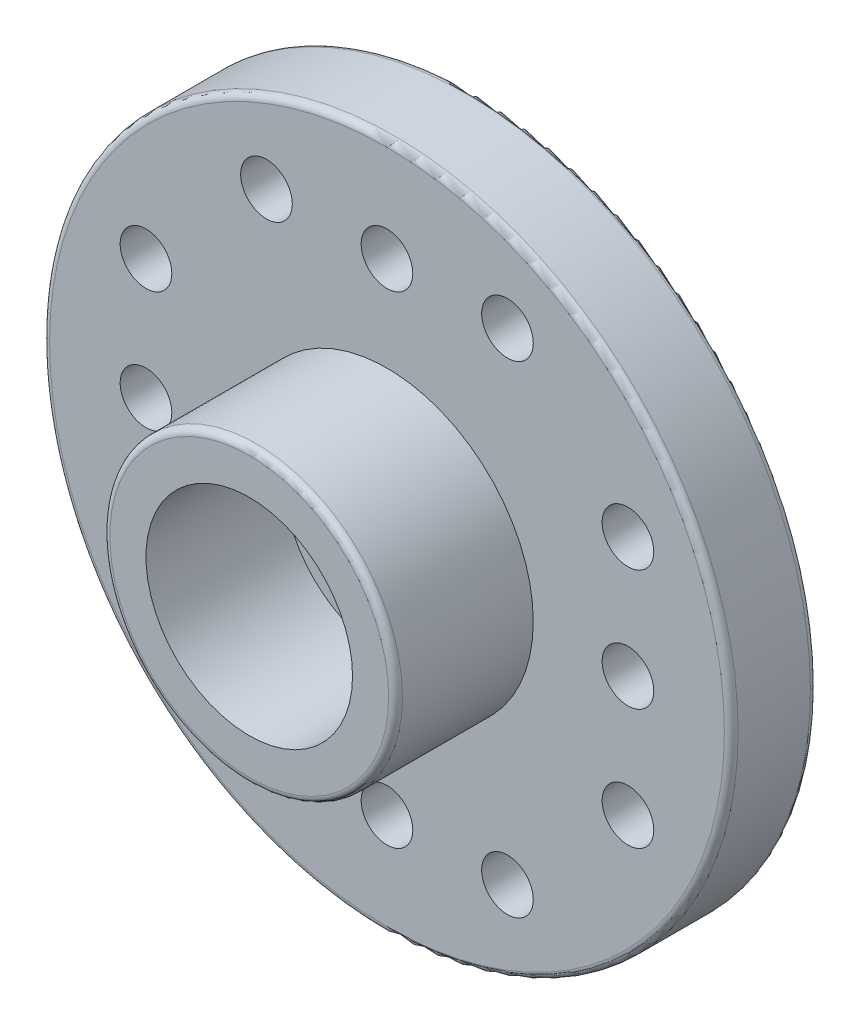
ISO-10303-21;
HEADER;
FILE_DESCRIPTION(('STEP AP214'),'2;1');
FILE_NAME('part.step','',(''),(''),'','','');
FILE_SCHEMA(('AUTOMOTIVE_DESIGN { 1 0 10303 214 1 1 1 1 }'));
ENDSEC;
DATA;
#1=APPLICATION_CONTEXT('core data for automotive mechanical design processes');
#2=APPLICATION_PROTOCOL_DEFINITION('international standard','automotive_design',2000,#1);
#3=PRODUCT_CONTEXT('',#1,'mechanical');
#4=PRODUCT('Part','Part','',(#3));
#5=PRODUCT_RELATED_PRODUCT_CATEGORY('part','',(#4));
#6=PRODUCT_DEFINITION_FORMATION('','',#4);
#7=PRODUCT_DEFINITION_CONTEXT('part definition',#1,'design');
#8=PRODUCT_DEFINITION('design','',#6,#7);
#9=PRODUCT_DEFINITION_SHAPE('','',#8);
#10=(LENGTH_UNIT() NAMED_UNIT(*) SI_UNIT(.MILLI.,.METRE.));
#11=(NAMED_UNIT(*) PLANE_ANGLE_UNIT() SI_UNIT($,.RADIAN.));
#12=(NAMED_UNIT(*) SI_UNIT($,.STERADIAN.) SOLID_ANGLE_UNIT());
#13=UNCERTAINTY_MEASURE_WITH_UNIT(LENGTH_MEASURE(1.E-05),#10,'distance_accuracy_value','');
#14=(GEOMETRIC_REPRESENTATION_CONTEXT(3) GLOBAL_UNCERTAINTY_ASSIGNED_CONTEXT((#13)) GLOBAL_UNIT_ASSIGNED_CONTEXT((#10,
#11,#12)) REPRESENTATION_CONTEXT('',''));
#15=CARTESIAN_POINT('',(0.,0.,0.));
#16=DIRECTION('',(0.,0.,1.));
#17=DIRECTION('',(1.,0.,0.));
#18=AXIS2_PLACEMENT_3D('',#15,#16,#17);
#19=CARTESIAN_POINT('',(0.,0.,0.8));
#20=DIRECTION('',(0.,0.,-1.));
#21=DIRECTION('',(-1.,0.,0.));
#22=AXIS2_PLACEMENT_3D('',#19,#20,#21);
#23=PLANE('',#22);
#24=CARTESIAN_POINT('',(0.,0.,0.8));
#25=DIRECTION('',(0.,0.,-1.));
#26=DIRECTION('',(-1.,0.,0.));
#27=AXIS2_PLACEMENT_3D('',#24,#25,#26);
#28=CIRCLE('',#27,4.5);
#29=CARTESIAN_POINT('',(-4.5,0.,0.8));
#30=VERTEX_POINT('',#29);
#31=EDGE_CURVE('E74',#30,#30,#28,.T.);
#32=ORIENTED_EDGE('',*,*,#31,.T.);
#33=EDGE_LOOP('',(#32));
#34=FACE_BOUND('',#33,.T.);
#35=CARTESIAN_POINT('',(0.,0.,0.8));
#36=DIRECTION('',(0.,0.,-1.));
#37=DIRECTION('',(-1.,0.,0.));
#38=AXIS2_PLACEMENT_3D('',#35,#36,#37);
#39=CIRCLE('',#38,3.7);
#40=CARTESIAN_POINT('',(-3.7,0.,0.8));
#41=VERTEX_POINT('',#40);
#42=EDGE_CURVE('E160',#41,#41,#39,.T.);
#43=ORIENTED_EDGE('',*,*,#42,.F.);
#44=EDGE_LOOP('',(#43));
#45=FACE_BOUND('',#44,.T.);
#46=ADVANCED_FACE('F34',(#34,#45),#23,.T.);
#47=CARTESIAN_POINT('',(0.,0.,2.5));
#48=DIRECTION('',(0.,0.,-1.));
#49=DIRECTION('',(-1.,0.,0.));
#50=AXIS2_PLACEMENT_3D('',#47,#48,#49);
#51=CYLINDRICAL_SURFACE('',#50,1.5);
#52=CARTESIAN_POINT('',(0.,0.,2.5));
#53=DIRECTION('',(0.,0.,1.));
#54=DIRECTION('',(1.,0.,0.));
#55=AXIS2_PLACEMENT_3D('',#52,#53,#54);
#56=CIRCLE('',#55,1.5);
#57=CARTESIAN_POINT('',(1.5,0.,2.5));
#58=VERTEX_POINT('',#57);
#59=EDGE_CURVE('E147',#58,#58,#56,.T.);
#60=ORIENTED_EDGE('',*,*,#59,.T.);
#61=EDGE_LOOP('',(#60));
#62=FACE_BOUND('',#61,.T.);
#63=CARTESIAN_POINT('',(0.,0.,0.8));
#64=DIRECTION('',(0.,0.,-1.));
#65=DIRECTION('',(-1.,0.,0.));
#66=AXIS2_PLACEMENT_3D('',#63,#64,#65);
#67=CIRCLE('',#66,1.5);
#68=CARTESIAN_POINT('',(-1.5,0.,0.8));
#69=VERTEX_POINT('',#68);
#70=EDGE_CURVE('E70',#69,#69,#67,.T.);
#71=ORIENTED_EDGE('',*,*,#70,.T.);
#72=EDGE_LOOP('',(#71));
#73=FACE_BOUND('',#72,.T.);
#74=ADVANCED_FACE('F189',(#62,#73),#51,.F.);
#75=CARTESIAN_POINT('',(0.,0.,2.5));
#76=DIRECTION('',(0.,0.,1.));
#77=DIRECTION('',(1.,0.,0.));
#78=AXIS2_PLACEMENT_3D('',#75,#76,#77);
#79=PLANE('',#78);
#80=CARTESIAN_POINT('',(0.,0.,2.5));
#81=DIRECTION('',(0.,0.,1.));
#82=DIRECTION('',(1.,0.,0.));
#83=AXIS2_PLACEMENT_3D('',#80,#81,#82);
#84=CIRCLE('',#83,9.79999999999866);
#85=CARTESIAN_POINT('',(9.79999999999866,0.,2.5));
#86=VERTEX_POINT('',#85);
#87=EDGE_CURVE('E10',#86,#86,#84,.T.);
#88=ORIENTED_EDGE('',*,*,#87,.T.);
#89=EDGE_LOOP('',(#88));
#90=FACE_BOUND('',#89,.T.);
#91=CARTESIAN_POINT('',(-7.,3.5,2.5));
#92=DIRECTION('',(0.,0.,1.));
#93=DIRECTION('',(1.,0.,0.));
#94=AXIS2_PLACEMENT_3D('',#91,#92,#93);
#95=CIRCLE('',#94,0.749999999999998);
#96=CARTESIAN_POINT('',(-6.25,3.5,2.5));
#97=VERTEX_POINT('',#96);
#98=EDGE_CURVE('E141',#97,#97,#95,.T.);
#99=ORIENTED_EDGE('',*,*,#98,.F.);
#100=EDGE_LOOP('',(#99));
#101=FACE_BOUND('',#100,.T.);
#102=CARTESIAN_POINT('',(-3.49999999999973,-6.99999999999993,2.5));
#103=DIRECTION('',(0.,0.,1.));
#104=DIRECTION('',(1.,0.,0.));
#105=AXIS2_PLACEMENT_3D('',#102,#103,#104);
#106=CIRCLE('',#105,0.749999999999999);
#107=CARTESIAN_POINT('',(-2.74999999999974,-6.99999999999993,2.5));
#108=VERTEX_POINT('',#107);
#109=EDGE_CURVE('E129',#108,#108,#106,.T.);
#110=ORIENTED_EDGE('',*,*,#109,.F.);
#111=EDGE_LOOP('',(#110));
#112=FACE_BOUND('',#111,.T.);
#113=CARTESIAN_POINT('',(2.65831209225568E-13,-6.99999999999993,2.5));
#114=DIRECTION('',(0.,0.,1.));
#115=DIRECTION('',(1.,0.,0.));
#116=AXIS2_PLACEMENT_3D('',#113,#114,#115);
#117=CIRCLE('',#116,0.749999999999999);
#118=CARTESIAN_POINT('',(0.750000000000265,-6.99999999999993,2.5));
#119=VERTEX_POINT('',#118);
#120=EDGE_CURVE('E117',#119,#119,#117,.T.);
#121=ORIENTED_EDGE('',*,*,#120,.F.);
#122=EDGE_LOOP('',(#121));
#123=FACE_BOUND('',#122,.T.);
#124=CARTESIAN_POINT('',(7.0000000000002,3.50000000000033,2.5));
#125=DIRECTION('',(0.,0.,1.));
#126=DIRECTION('',(1.,0.,0.));
#127=AXIS2_PLACEMENT_3D('',#124,#125,#126);
#128=CIRCLE('',#127,0.749999999999998);
#129=CARTESIAN_POINT('',(7.7500000000002,3.50000000000033,2.5));
#130=VERTEX_POINT('',#129);
#131=EDGE_CURVE('E105',#130,#130,#128,.T.);
#132=ORIENTED_EDGE('',*,*,#131,.F.);
#133=EDGE_LOOP('',(#132));
#134=FACE_BOUND('',#133,.T.);
#135=CARTESIAN_POINT('',(3.49999999999993,7.00000000000027,2.5));
#136=DIRECTION('',(0.,0.,1.));
#137=DIRECTION('',(1.,0.,0.));
#138=AXIS2_PLACEMENT_3D('',#135,#136,#137);
#139=CIRCLE('',#138,0.749999999999999);
#140=CARTESIAN_POINT('',(4.24999999999993,7.00000000000027,2.5));
#141=VERTEX_POINT('',#140);
#142=EDGE_CURVE('E93',#141,#141,#139,.T.);
#143=ORIENTED_EDGE('',*,*,#142,.F.);
#144=EDGE_LOOP('',(#143));
#145=FACE_BOUND('',#144,.T.);
#146=CARTESIAN_POINT('',(0.,7.00000000000026,2.5));
#147=DIRECTION('',(0.,0.,1.));
#148=DIRECTION('',(1.,0.,0.));
#149=AXIS2_PLACEMENT_3D('',#146,#147,#148);
#150=CIRCLE('',#149,0.749999999999999);
#151=CARTESIAN_POINT('',(0.74999999999993,7.00000000000026,2.5));
#152=VERTEX_POINT('',#151);
#153=EDGE_CURVE('E81',#152,#152,#150,.T.);
#154=ORIENTED_EDGE('',*,*,#153,.F.);
#155=EDGE_LOOP('',(#154));
#156=FACE_BOUND('',#155,.T.);
#157=CARTESIAN_POINT('',(-7.,0.,2.5));
#158=DIRECTION('',(0.,0.,1.));
#159=DIRECTION('',(1.,0.,0.));
#160=AXIS2_PLACEMENT_3D('',#157,#158,#159);
#161=CIRCLE('',#160,0.749999999999998);
#162=CARTESIAN_POINT('',(-6.25,0.,2.5));
#163=VERTEX_POINT('',#162);
#164=EDGE_CURVE('E77',#163,#163,#161,.T.);
#165=ORIENTED_EDGE('',*,*,#164,.F.);
#166=EDGE_LOOP('',(#165));
#167=FACE_BOUND('',#166,.T.);
#168=CARTESIAN_POINT('',(-3.50000000000007,7.00000000000027,2.5));
#169=DIRECTION('',(0.,0.,1.));
#170=DIRECTION('',(1.,0.,0.));
#171=AXIS2_PLACEMENT_3D('',#168,#169,#170);
#172=CIRCLE('',#171,0.749999999999998);
#173=CARTESIAN_POINT('',(-2.75000000000007,7.00000000000027,2.5));
#174=VERTEX_POINT('',#173);
#175=EDGE_CURVE('E87',#174,#174,#172,.T.);
#176=ORIENTED_EDGE('',*,*,#175,.F.);
#177=EDGE_LOOP('',(#176));
#178=FACE_BOUND('',#177,.T.);
#179=CARTESIAN_POINT('',(7.0000000000002,3.3392416014695E-13,2.5));
#180=DIRECTION('',(0.,0.,1.));
#181=DIRECTION('',(1.,0.,0.));
#182=AXIS2_PLACEMENT_3D('',#179,#180,#181);
#183=CIRCLE('',#182,0.749999999999999);
#184=CARTESIAN_POINT('',(7.7500000000002,3.3392416014695E-13,2.5));
#185=VERTEX_POINT('',#184);
#186=EDGE_CURVE('E99',#185,#185,#183,.T.);
#187=ORIENTED_EDGE('',*,*,#186,.F.);
#188=EDGE_LOOP('',(#187));
#189=FACE_BOUND('',#188,.T.);
#190=CARTESIAN_POINT('',(7.0000000000002,-3.49999999999967,2.5));
#191=DIRECTION('',(0.,0.,1.));
#192=DIRECTION('',(1.,0.,0.));
#193=AXIS2_PLACEMENT_3D('',#190,#191,#192);
#194=CIRCLE('',#193,0.749999999999998);
#195=CARTESIAN_POINT('',(7.7500000000002,-3.49999999999967,2.5));
#196=VERTEX_POINT('',#195);
#197=EDGE_CURVE('E111',#196,#196,#194,.T.);
#198=ORIENTED_EDGE('',*,*,#197,.F.);
#199=EDGE_LOOP('',(#198));
#200=FACE_BOUND('',#199,.T.);
#201=CARTESIAN_POINT('',(3.50000000000027,-6.99999999999993,2.5));
#202=DIRECTION('',(0.,0.,1.));
#203=DIRECTION('',(1.,0.,0.));
#204=AXIS2_PLACEMENT_3D('',#201,#202,#203);
#205=CIRCLE('',#204,0.749999999999998);
#206=CARTESIAN_POINT('',(4.25000000000026,-6.99999999999993,2.5));
#207=VERTEX_POINT('',#206);
#208=EDGE_CURVE('E123',#207,#207,#205,.T.);
#209=ORIENTED_EDGE('',*,*,#208,.F.);
#210=EDGE_LOOP('',(#209));
#211=FACE_BOUND('',#210,.T.);
#212=CARTESIAN_POINT('',(-7.,-3.5,2.5));
#213=DIRECTION('',(0.,0.,1.));
#214=DIRECTION('',(1.,0.,0.));
#215=AXIS2_PLACEMENT_3D('',#212,#213,#214);
#216=CIRCLE('',#215,0.749999999999998);
#217=CARTESIAN_POINT('',(-6.25,-3.5,2.5));
#218=VERTEX_POINT('',#217);
#219=EDGE_CURVE('E135',#218,#218,#216,.T.);
#220=ORIENTED_EDGE('',*,*,#219,.F.);
#221=EDGE_LOOP('',(#220));
#222=FACE_BOUND('',#221,.T.);
#223=CARTESIAN_POINT('',(0.,0.,2.5));
#224=DIRECTION('',(0.,0.,1.));
#225=DIRECTION('',(1.,0.,0.));
#226=AXIS2_PLACEMENT_3D('',#223,#224,#225);
#227=CIRCLE('',#226,4.25);
#228=CARTESIAN_POINT('',(4.25,0.,2.5));
#229=VERTEX_POINT('',#228);
#230=EDGE_CURVE('E152',#229,#229,#227,.T.);
#231=ORIENTED_EDGE('',*,*,#230,.F.);
#232=EDGE_LOOP('',(#231));
#233=FACE_BOUND('',#232,.T.);
#234=ADVANCED_FACE('F194',(#90,#101,#112,#123,#134,#145,#156,#167,#178,#189,#200,#211,#222,
#233),#79,.T.);
#235=CARTESIAN_POINT('',(0.,0.,2.5));
#236=DIRECTION('',(0.,0.,1.));
#237=DIRECTION('',(1.,0.,0.));
#238=AXIS2_PLACEMENT_3D('',#235,#236,#237);
#239=CIRCLE('',#238,3.);
#240=CARTESIAN_POINT('',(3.,0.,2.5));
#241=VERTEX_POINT('',#240);
#242=EDGE_CURVE('E69',#241,#241,#239,.F.);
#243=ORIENTED_EDGE('',*,*,#242,.F.);
#244=EDGE_LOOP('',(#243));
#245=FACE_BOUND('',#244,.T.);
#246=ORIENTED_EDGE('',*,*,#59,.F.);
#247=EDGE_LOOP('',(#246));
#248=FACE_BOUND('',#247,.T.);
#249=ADVANCED_FACE('F263',(#245,#248),#79,.T.);
#250=CARTESIAN_POINT('',(0.,0.,0.));
#251=DIRECTION('',(0.,0.,1.));
#252=DIRECTION('',(1.,0.,0.));
#253=AXIS2_PLACEMENT_3D('',#250,#251,#252);
#254=PLANE('',#253);
#255=CARTESIAN_POINT('',(0.,0.,0.));
#256=DIRECTION('',(0.,0.,1.));
#257=DIRECTION('',(1.,0.,0.));
#258=AXIS2_PLACEMENT_3D('',#255,#256,#257);
#259=CIRCLE('',#258,4.7);
#260=CARTESIAN_POINT('',(4.7,0.,0.));
#261=VERTEX_POINT('',#260);
#262=EDGE_CURVE('E57',#261,#261,#259,.T.);
#263=ORIENTED_EDGE('',*,*,#262,.T.);
#264=EDGE_LOOP('',(#263));
#265=FACE_BOUND('',#264,.T.);
#266=CARTESIAN_POINT('',(0.,0.,0.));
#267=DIRECTION('',(0.,0.,1.));
#268=DIRECTION('',(1.,0.,0.));
#269=AXIS2_PLACEMENT_3D('',#266,#267,#268);
#270=CIRCLE('',#269,9.79999999999866);
#271=CARTESIAN_POINT('',(9.79999999999866,0.,0.));
#272=VERTEX_POINT('',#271);
#273=EDGE_CURVE('E60',#272,#272,#270,.F.);
#274=ORIENTED_EDGE('',*,*,#273,.T.);
#275=EDGE_LOOP('',(#274));
#276=FACE_BOUND('',#275,.T.);
#277=CARTESIAN_POINT('',(-7.,3.5,0.));
#278=DIRECTION('',(0.,0.,1.));
#279=DIRECTION('',(1.,0.,0.));
#280=AXIS2_PLACEMENT_3D('',#277,#278,#279);
#281=CIRCLE('',#280,0.749999999999998);
#282=CARTESIAN_POINT('',(-6.25,3.5,0.));
#283=VERTEX_POINT('',#282);
#284=EDGE_CURVE('E144',#283,#283,#281,.T.);
#285=ORIENTED_EDGE('',*,*,#284,.T.);
#286=EDGE_LOOP('',(#285));
#287=FACE_BOUND('',#286,.T.);
#288=CARTESIAN_POINT('',(-3.49999999999973,-6.99999999999993,0.));
#289=DIRECTION('',(0.,0.,1.));
#290=DIRECTION('',(1.,0.,0.));
#291=AXIS2_PLACEMENT_3D('',#288,#289,#290);
#292=CIRCLE('',#291,0.749999999999999);
#293=CARTESIAN_POINT('',(-2.74999999999974,-6.99999999999993,0.));
#294=VERTEX_POINT('',#293);
#295=EDGE_CURVE('E132',#294,#294,#292,.T.);
#296=ORIENTED_EDGE('',*,*,#295,.T.);
#297=EDGE_LOOP('',(#296));
#298=FACE_BOUND('',#297,.T.);
#299=CARTESIAN_POINT('',(2.65831209225568E-13,-6.99999999999993,0.));
#300=DIRECTION('',(0.,0.,1.));
#301=DIRECTION('',(1.,0.,0.));
#302=AXIS2_PLACEMENT_3D('',#299,#300,#301);
#303=CIRCLE('',#302,0.749999999999999);
#304=CARTESIAN_POINT('',(0.750000000000265,-6.99999999999993,0.));
#305=VERTEX_POINT('',#304);
#306=EDGE_CURVE('E120',#305,#305,#303,.T.);
#307=ORIENTED_EDGE('',*,*,#306,.T.);
#308=EDGE_LOOP('',(#307));
#309=FACE_BOUND('',#308,.T.);
#310=CARTESIAN_POINT('',(7.0000000000002,3.50000000000033,0.));
#311=DIRECTION('',(0.,0.,1.));
#312=DIRECTION('',(1.,0.,0.));
#313=AXIS2_PLACEMENT_3D('',#310,#311,#312);
#314=CIRCLE('',#313,0.749999999999998);
#315=CARTESIAN_POINT('',(7.7500000000002,3.50000000000033,0.));
#316=VERTEX_POINT('',#315);
#317=EDGE_CURVE('E108',#316,#316,#314,.T.);
#318=ORIENTED_EDGE('',*,*,#317,.T.);
#319=EDGE_LOOP('',(#318));
#320=FACE_BOUND('',#319,.T.);
#321=CARTESIAN_POINT('',(3.49999999999993,7.00000000000027,0.));
#322=DIRECTION('',(0.,0.,1.));
#323=DIRECTION('',(1.,0.,0.));
#324=AXIS2_PLACEMENT_3D('',#321,#322,#323);
#325=CIRCLE('',#324,0.749999999999999);
#326=CARTESIAN_POINT('',(4.24999999999993,7.00000000000027,0.));
#327=VERTEX_POINT('',#326);
#328=EDGE_CURVE('E96',#327,#327,#325,.T.);
#329=ORIENTED_EDGE('',*,*,#328,.T.);
#330=EDGE_LOOP('',(#329));
#331=FACE_BOUND('',#330,.T.);
#332=CARTESIAN_POINT('',(0.,7.00000000000026,0.));
#333=DIRECTION('',(0.,0.,1.));
#334=DIRECTION('',(1.,0.,0.));
#335=AXIS2_PLACEMENT_3D('',#332,#333,#334);
#336=CIRCLE('',#335,0.749999999999999);
#337=CARTESIAN_POINT('',(0.74999999999993,7.00000000000026,0.));
#338=VERTEX_POINT('',#337);
#339=EDGE_CURVE('E84',#338,#338,#336,.T.);
#340=ORIENTED_EDGE('',*,*,#339,.T.);
#341=EDGE_LOOP('',(#340));
#342=FACE_BOUND('',#341,.T.);
#343=CARTESIAN_POINT('',(-7.,0.,0.));
#344=DIRECTION('',(0.,0.,1.));
#345=DIRECTION('',(1.,0.,0.));
#346=AXIS2_PLACEMENT_3D('',#343,#344,#345);
#347=CIRCLE('',#346,0.749999999999998);
#348=CARTESIAN_POINT('',(-6.25,0.,0.));
#349=VERTEX_POINT('',#348);
#350=EDGE_CURVE('E78',#349,#349,#347,.T.);
#351=ORIENTED_EDGE('',*,*,#350,.T.);
#352=EDGE_LOOP('',(#351));
#353=FACE_BOUND('',#352,.T.);
#354=CARTESIAN_POINT('',(-3.50000000000007,7.00000000000027,0.));
#355=DIRECTION('',(0.,0.,1.));
#356=DIRECTION('',(1.,0.,0.));
#357=AXIS2_PLACEMENT_3D('',#354,#355,#356);
#358=CIRCLE('',#357,0.749999999999998);
#359=CARTESIAN_POINT('',(-2.75000000000007,7.00000000000027,0.));
#360=VERTEX_POINT('',#359);
#361=EDGE_CURVE('E90',#360,#360,#358,.T.);
#362=ORIENTED_EDGE('',*,*,#361,.T.);
#363=EDGE_LOOP('',(#362));
#364=FACE_BOUND('',#363,.T.);
#365=CARTESIAN_POINT('',(7.0000000000002,3.3392416014695E-13,0.));
#366=DIRECTION('',(0.,0.,1.));
#367=DIRECTION('',(1.,0.,0.));
#368=AXIS2_PLACEMENT_3D('',#365,#366,#367);
#369=CIRCLE('',#368,0.749999999999999);
#370=CARTESIAN_POINT('',(7.7500000000002,3.3392416014695E-13,0.));
#371=VERTEX_POINT('',#370);
#372=EDGE_CURVE('E102',#371,#371,#369,.T.);
#373=ORIENTED_EDGE('',*,*,#372,.T.);
#374=EDGE_LOOP('',(#373));
#375=FACE_BOUND('',#374,.T.);
#376=CARTESIAN_POINT('',(7.0000000000002,-3.49999999999967,0.));
#377=DIRECTION('',(0.,0.,1.));
#378=DIRECTION('',(1.,0.,0.));
#379=AXIS2_PLACEMENT_3D('',#376,#377,#378);
#380=CIRCLE('',#379,0.749999999999998);
#381=CARTESIAN_POINT('',(7.7500000000002,-3.49999999999967,0.));
#382=VERTEX_POINT('',#381);
#383=EDGE_CURVE('E114',#382,#382,#380,.T.);
#384=ORIENTED_EDGE('',*,*,#383,.T.);
#385=EDGE_LOOP('',(#384));
#386=FACE_BOUND('',#385,.T.);
#387=CARTESIAN_POINT('',(3.50000000000027,-6.99999999999993,0.));
#388=DIRECTION('',(0.,0.,1.));
#389=DIRECTION('',(1.,0.,0.));
#390=AXIS2_PLACEMENT_3D('',#387,#388,#389);
#391=CIRCLE('',#390,0.749999999999998);
#392=CARTESIAN_POINT('',(4.25000000000026,-6.99999999999993,0.));
#393=VERTEX_POINT('',#392);
#394=EDGE_CURVE('E126',#393,#393,#391,.T.);
#395=ORIENTED_EDGE('',*,*,#394,.T.);
#396=EDGE_LOOP('',(#395));
#397=FACE_BOUND('',#396,.T.);
#398=CARTESIAN_POINT('',(-7.,-3.5,0.));
#399=DIRECTION('',(0.,0.,1.));
#400=DIRECTION('',(1.,0.,0.));
#401=AXIS2_PLACEMENT_3D('',#398,#399,#400);
#402=CIRCLE('',#401,0.749999999999998);
#403=CARTESIAN_POINT('',(-6.25,-3.5,0.));
#404=VERTEX_POINT('',#403);
#405=EDGE_CURVE('E138',#404,#404,#402,.T.);
#406=ORIENTED_EDGE('',*,*,#405,.T.);
#407=EDGE_LOOP('',(#406));
#408=FACE_BOUND('',#407,.T.);
#409=ADVANCED_FACE('F266',(#265,#276,#287,#298,#309,#320,#331,#342,#353,#364,#375,#386,#397,
#408),#254,.F.);
#410=CARTESIAN_POINT('',(0.,0.,2.5));
#411=DIRECTION('',(0.,0.,-1.));
#412=DIRECTION('',(-1.,0.,0.));
#413=AXIS2_PLACEMENT_3D('',#410,#411,#412);
#414=CYLINDRICAL_SURFACE('',#413,9.99999999999866);
#415=CARTESIAN_POINT('',(0.,0.,0.2));
#416=DIRECTION('',(0.,0.,1.));
#417=DIRECTION('',(1.,0.,0.));
#418=AXIS2_PLACEMENT_3D('',#415,#416,#417);
#419=CIRCLE('',#418,9.99999999999866);
#420=CARTESIAN_POINT('',(9.99999999999866,0.,0.2));
#421=VERTEX_POINT('',#420);
#422=EDGE_CURVE('E41',#421,#421,#419,.T.);
#423=ORIENTED_EDGE('',*,*,#422,.T.);
#424=EDGE_LOOP('',(#423));
#425=FACE_BOUND('',#424,.T.);
#426=CARTESIAN_POINT('',(0.,0.,2.3));
#427=DIRECTION('',(0.,0.,1.));
#428=DIRECTION('',(1.,0.,0.));
#429=AXIS2_PLACEMENT_3D('',#426,#427,#428);
#430=CIRCLE('',#429,9.99999999999866);
#431=CARTESIAN_POINT('',(9.99999999999866,0.,2.3));
#432=VERTEX_POINT('',#431);
#433=EDGE_CURVE('E45',#432,#432,#430,.F.);
#434=ORIENTED_EDGE('',*,*,#433,.T.);
#435=EDGE_LOOP('',(#434));
#436=FACE_BOUND('',#435,.T.);
#437=ADVANCED_FACE('F261',(#425,#436),#414,.T.);
#438=CARTESIAN_POINT('',(-7.,0.,2.5));
#439=DIRECTION('',(0.,0.,-1.));
#440=DIRECTION('',(-1.,0.,0.));
#441=AXIS2_PLACEMENT_3D('',#438,#439,#440);
#442=CYLINDRICAL_SURFACE('',#441,0.749999999999998);
#443=ORIENTED_EDGE('',*,*,#164,.T.);
#444=EDGE_LOOP('',(#443));
#445=FACE_BOUND('',#444,.T.);
#446=ORIENTED_EDGE('',*,*,#350,.F.);
#447=EDGE_LOOP('',(#446));
#448=FACE_BOUND('',#447,.T.);
#449=ADVANCED_FACE('F257',(#445,#448),#442,.F.);
#450=CARTESIAN_POINT('',(0.,7.00000000000026,2.5));
#451=DIRECTION('',(0.,0.,-1.));
#452=DIRECTION('',(-1.,0.,0.));
#453=AXIS2_PLACEMENT_3D('',#450,#451,#452);
#454=CYLINDRICAL_SURFACE('',#453,0.749999999999999);
#455=ORIENTED_EDGE('',*,*,#153,.T.);
#456=EDGE_LOOP('',(#455));
#457=FACE_BOUND('',#456,.T.);
#458=ORIENTED_EDGE('',*,*,#339,.F.);
#459=EDGE_LOOP('',(#458));
#460=FACE_BOUND('',#459,.T.);
#461=ADVANCED_FACE('F253',(#457,#460),#454,.F.);
#462=CARTESIAN_POINT('',(-3.50000000000007,7.00000000000027,2.5));
#463=DIRECTION('',(0.,0.,-1.));
#464=DIRECTION('',(-1.,0.,0.));
#465=AXIS2_PLACEMENT_3D('',#462,#463,#464);
#466=CYLINDRICAL_SURFACE('',#465,0.749999999999998);
#467=ORIENTED_EDGE('',*,*,#175,.T.);
#468=EDGE_LOOP('',(#467));
#469=FACE_BOUND('',#468,.T.);
#470=ORIENTED_EDGE('',*,*,#361,.F.);
#471=EDGE_LOOP('',(#470));
#472=FACE_BOUND('',#471,.T.);
#473=ADVANCED_FACE('F249',(#469,#472),#466,.F.);
#474=CARTESIAN_POINT('',(3.49999999999993,7.00000000000027,2.5));
#475=DIRECTION('',(0.,0.,-1.));
#476=DIRECTION('',(-1.,0.,0.));
#477=AXIS2_PLACEMENT_3D('',#474,#475,#476);
#478=CYLINDRICAL_SURFACE('',#477,0.749999999999999);
#479=ORIENTED_EDGE('',*,*,#142,.T.);
#480=EDGE_LOOP('',(#479));
#481=FACE_BOUND('',#480,.T.);
#482=ORIENTED_EDGE('',*,*,#328,.F.);
#483=EDGE_LOOP('',(#482));
#484=FACE_BOUND('',#483,.T.);
#485=ADVANCED_FACE('F245',(#481,#484),#478,.F.);
#486=CARTESIAN_POINT('',(7.0000000000002,3.3392416014695E-13,2.5));
#487=DIRECTION('',(0.,0.,-1.));
#488=DIRECTION('',(-1.,0.,0.));
#489=AXIS2_PLACEMENT_3D('',#486,#487,#488);
#490=CYLINDRICAL_SURFACE('',#489,0.749999999999999);
#491=ORIENTED_EDGE('',*,*,#186,.T.);
#492=EDGE_LOOP('',(#491));
#493=FACE_BOUND('',#492,.T.);
#494=ORIENTED_EDGE('',*,*,#372,.F.);
#495=EDGE_LOOP('',(#494));
#496=FACE_BOUND('',#495,.T.);
#497=ADVANCED_FACE('F241',(#493,#496),#490,.F.);
#498=CARTESIAN_POINT('',(7.0000000000002,3.50000000000033,2.5));
#499=DIRECTION('',(0.,0.,-1.));
#500=DIRECTION('',(-1.,0.,0.));
#501=AXIS2_PLACEMENT_3D('',#498,#499,#500);
#502=CYLINDRICAL_SURFACE('',#501,0.749999999999998);
#503=ORIENTED_EDGE('',*,*,#131,.T.);
#504=EDGE_LOOP('',(#503));
#505=FACE_BOUND('',#504,.T.);
#506=ORIENTED_EDGE('',*,*,#317,.F.);
#507=EDGE_LOOP('',(#506));
#508=FACE_BOUND('',#507,.T.);
#509=ADVANCED_FACE('F237',(#505,#508),#502,.F.);
#510=CARTESIAN_POINT('',(7.0000000000002,-3.49999999999967,2.5));
#511=DIRECTION('',(0.,0.,-1.));
#512=DIRECTION('',(-1.,0.,0.));
#513=AXIS2_PLACEMENT_3D('',#510,#511,#512);
#514=CYLINDRICAL_SURFACE('',#513,0.749999999999998);
#515=ORIENTED_EDGE('',*,*,#197,.T.);
#516=EDGE_LOOP('',(#515));
#517=FACE_BOUND('',#516,.T.);
#518=ORIENTED_EDGE('',*,*,#383,.F.);
#519=EDGE_LOOP('',(#518));
#520=FACE_BOUND('',#519,.T.);
#521=ADVANCED_FACE('F233',(#517,#520),#514,.F.);
#522=CARTESIAN_POINT('',(2.65831209225568E-13,-6.99999999999993,2.5));
#523=DIRECTION('',(0.,0.,-1.));
#524=DIRECTION('',(-1.,0.,0.));
#525=AXIS2_PLACEMENT_3D('',#522,#523,#524);
#526=CYLINDRICAL_SURFACE('',#525,0.749999999999999);
#527=ORIENTED_EDGE('',*,*,#120,.T.);
#528=EDGE_LOOP('',(#527));
#529=FACE_BOUND('',#528,.T.);
#530=ORIENTED_EDGE('',*,*,#306,.F.);
#531=EDGE_LOOP('',(#530));
#532=FACE_BOUND('',#531,.T.);
#533=ADVANCED_FACE('F229',(#529,#532),#526,.F.);
#534=CARTESIAN_POINT('',(3.50000000000027,-6.99999999999993,2.5));
#535=DIRECTION('',(0.,0.,-1.));
#536=DIRECTION('',(-1.,0.,0.));
#537=AXIS2_PLACEMENT_3D('',#534,#535,#536);
#538=CYLINDRICAL_SURFACE('',#537,0.749999999999998);
#539=ORIENTED_EDGE('',*,*,#208,.T.);
#540=EDGE_LOOP('',(#539));
#541=FACE_BOUND('',#540,.T.);
#542=ORIENTED_EDGE('',*,*,#394,.F.);
#543=EDGE_LOOP('',(#542));
#544=FACE_BOUND('',#543,.T.);
#545=ADVANCED_FACE('F225',(#541,#544),#538,.F.);
#546=CARTESIAN_POINT('',(-3.49999999999973,-6.99999999999993,2.5));
#547=DIRECTION('',(0.,0.,-1.));
#548=DIRECTION('',(-1.,0.,0.));
#549=AXIS2_PLACEMENT_3D('',#546,#547,#548);
#550=CYLINDRICAL_SURFACE('',#549,0.749999999999999);
#551=ORIENTED_EDGE('',*,*,#109,.T.);
#552=EDGE_LOOP('',(#551));
#553=FACE_BOUND('',#552,.T.);
#554=ORIENTED_EDGE('',*,*,#295,.F.);
#555=EDGE_LOOP('',(#554));
#556=FACE_BOUND('',#555,.T.);
#557=ADVANCED_FACE('F221',(#553,#556),#550,.F.);
#558=CARTESIAN_POINT('',(-7.,-3.5,2.5));
#559=DIRECTION('',(0.,0.,-1.));
#560=DIRECTION('',(-1.,0.,0.));
#561=AXIS2_PLACEMENT_3D('',#558,#559,#560);
#562=CYLINDRICAL_SURFACE('',#561,0.749999999999998);
#563=ORIENTED_EDGE('',*,*,#219,.T.);
#564=EDGE_LOOP('',(#563));
#565=FACE_BOUND('',#564,.T.);
#566=ORIENTED_EDGE('',*,*,#405,.F.);
#567=EDGE_LOOP('',(#566));
#568=FACE_BOUND('',#567,.T.);
#569=ADVANCED_FACE('F217',(#565,#568),#562,.F.);
#570=CARTESIAN_POINT('',(-7.,3.5,2.5));
#571=DIRECTION('',(0.,0.,-1.));
#572=DIRECTION('',(-1.,0.,0.));
#573=AXIS2_PLACEMENT_3D('',#570,#571,#572);
#574=CYLINDRICAL_SURFACE('',#573,0.749999999999998);
#575=ORIENTED_EDGE('',*,*,#98,.T.);
#576=EDGE_LOOP('',(#575));
#577=FACE_BOUND('',#576,.T.);
#578=ORIENTED_EDGE('',*,*,#284,.F.);
#579=EDGE_LOOP('',(#578));
#580=FACE_BOUND('',#579,.T.);
#581=ADVANCED_FACE('F210',(#577,#580),#574,.F.);
#582=CARTESIAN_POINT('',(0.,0.,6.5));
#583=DIRECTION('',(0.,0.,1.));
#584=DIRECTION('',(1.,0.,0.));
#585=AXIS2_PLACEMENT_3D('',#582,#583,#584);
#586=PLANE('',#585);
#587=CARTESIAN_POINT('',(0.,0.,6.5));
#588=DIRECTION('',(0.,0.,1.));
#589=DIRECTION('',(1.,0.,0.));
#590=AXIS2_PLACEMENT_3D('',#587,#588,#589);
#591=CIRCLE('',#590,4.05);
#592=CARTESIAN_POINT('',(4.05,0.,6.5));
#593=VERTEX_POINT('',#592);
#594=EDGE_CURVE('E54',#593,#593,#591,.T.);
#595=ORIENTED_EDGE('',*,*,#594,.T.);
#596=EDGE_LOOP('',(#595));
#597=FACE_BOUND('',#596,.T.);
#598=CARTESIAN_POINT('',(0.,0.,6.5));
#599=DIRECTION('',(0.,0.,1.));
#600=DIRECTION('',(1.,0.,0.));
#601=AXIS2_PLACEMENT_3D('',#598,#599,#600);
#602=CIRCLE('',#601,3.);
#603=CARTESIAN_POINT('',(3.,0.,6.5));
#604=VERTEX_POINT('',#603);
#605=EDGE_CURVE('E73',#604,#604,#602,.T.);
#606=ORIENTED_EDGE('',*,*,#605,.F.);
#607=EDGE_LOOP('',(#606));
#608=FACE_BOUND('',#607,.T.);
#609=ADVANCED_FACE('F207',(#597,#608),#586,.T.);
#610=CARTESIAN_POINT('',(0.,0.,6.5));
#611=DIRECTION('',(0.,0.,-1.));
#612=DIRECTION('',(-1.,0.,0.));
#613=AXIS2_PLACEMENT_3D('',#610,#611,#612);
#614=CYLINDRICAL_SURFACE('',#613,4.25);
#615=CARTESIAN_POINT('',(0.,0.,6.3));
#616=DIRECTION('',(0.,0.,1.));
#617=DIRECTION('',(1.,0.,0.));
#618=AXIS2_PLACEMENT_3D('',#615,#616,#617);
#619=CIRCLE('',#618,4.25);
#620=CARTESIAN_POINT('',(4.25,0.,6.3));
#621=VERTEX_POINT('',#620);
#622=EDGE_CURVE('E49',#621,#621,#619,.F.);
#623=ORIENTED_EDGE('',*,*,#622,.T.);
#624=EDGE_LOOP('',(#623));
#625=FACE_BOUND('',#624,.T.);
#626=ORIENTED_EDGE('',*,*,#230,.T.);
#627=EDGE_LOOP('',(#626));
#628=FACE_BOUND('',#627,.T.);
#629=ADVANCED_FACE('F205',(#625,#628),#614,.T.);
#630=CARTESIAN_POINT('',(0.,0.,6.5));
#631=DIRECTION('',(0.,0.,-1.));
#632=DIRECTION('',(-1.,0.,0.));
#633=AXIS2_PLACEMENT_3D('',#630,#631,#632);
#634=CYLINDRICAL_SURFACE('',#633,3.);
#635=ORIENTED_EDGE('',*,*,#605,.T.);
#636=EDGE_LOOP('',(#635));
#637=FACE_BOUND('',#636,.T.);
#638=ORIENTED_EDGE('',*,*,#242,.T.);
#639=EDGE_LOOP('',(#638));
#640=FACE_BOUND('',#639,.T.);
#641=ADVANCED_FACE('F201',(#637,#640),#634,.F.);
#642=CARTESIAN_POINT('',(0.,0.,0.8));
#643=DIRECTION('',(0.,0.,-1.));
#644=DIRECTION('',(-1.,0.,0.));
#645=AXIS2_PLACEMENT_3D('',#642,#643,#644);
#646=CYLINDRICAL_SURFACE('',#645,4.5);
#647=CARTESIAN_POINT('',(0.,0.,0.2));
#648=DIRECTION('',(0.,0.,1.));
#649=DIRECTION('',(1.,0.,0.));
#650=AXIS2_PLACEMENT_3D('',#647,#648,#649);
#651=CIRCLE('',#650,4.5);
#652=CARTESIAN_POINT('',(4.5,0.,0.2));
#653=VERTEX_POINT('',#652);
#654=EDGE_CURVE('E63',#653,#653,#651,.F.);
#655=ORIENTED_EDGE('',*,*,#654,.T.);
#656=EDGE_LOOP('',(#655));
#657=FACE_BOUND('',#656,.T.);
#658=ORIENTED_EDGE('',*,*,#31,.F.);
#659=EDGE_LOOP('',(#658));
#660=FACE_BOUND('',#659,.T.);
#661=ADVANCED_FACE('F184',(#657,#660),#646,.F.);
#662=CARTESIAN_POINT('',(0.,0.,0.8));
#663=DIRECTION('',(0.,0.,-1.));
#664=DIRECTION('',(-1.,0.,0.));
#665=AXIS2_PLACEMENT_3D('',#662,#663,#664);
#666=CIRCLE('',#665,3.5);
#667=CARTESIAN_POINT('',(-3.5,0.,0.8));
#668=VERTEX_POINT('',#667);
#669=EDGE_CURVE('E66',#668,#668,#666,.F.);
#670=ORIENTED_EDGE('',*,*,#669,.F.);
#671=EDGE_LOOP('',(#670));
#672=FACE_BOUND('',#671,.T.);
#673=ORIENTED_EDGE('',*,*,#70,.F.);
#674=EDGE_LOOP('',(#673));
#675=FACE_BOUND('',#674,.T.);
#676=ADVANCED_FACE('F175',(#672,#675),#23,.T.);
#677=CARTESIAN_POINT('',(0.,0.,0.));
#678=DIRECTION('',(0.,0.,-1.));
#679=DIRECTION('',(-1.,0.,0.));
#680=AXIS2_PLACEMENT_3D('',#677,#678,#679);
#681=PLANE('',#680);
#682=CARTESIAN_POINT('',(0.,0.,0.));
#683=DIRECTION('',(0.,0.,-1.));
#684=DIRECTION('',(-1.,0.,0.));
#685=AXIS2_PLACEMENT_3D('',#682,#683,#684);
#686=CIRCLE('',#685,3.7);
#687=CARTESIAN_POINT('',(-3.7,0.,0.));
#688=VERTEX_POINT('',#687);
#689=EDGE_CURVE('E159',#688,#688,#686,.T.);
#690=ORIENTED_EDGE('',*,*,#689,.T.);
#691=EDGE_LOOP('',(#690));
#692=FACE_BOUND('',#691,.T.);
#693=CARTESIAN_POINT('',(0.,0.,0.));
#694=DIRECTION('',(0.,0.,-1.));
#695=DIRECTION('',(-1.,0.,0.));
#696=AXIS2_PLACEMENT_3D('',#693,#694,#695);
#697=CIRCLE('',#696,3.5);
#698=CARTESIAN_POINT('',(-3.5,0.,0.));
#699=VERTEX_POINT('',#698);
#700=EDGE_CURVE('E163',#699,#699,#697,.T.);
#701=ORIENTED_EDGE('',*,*,#700,.F.);
#702=EDGE_LOOP('',(#701));
#703=FACE_BOUND('',#702,.T.);
#704=ADVANCED_FACE('F172',(#692,#703),#681,.T.);
#705=CARTESIAN_POINT('',(0.,0.,0.));
#706=DIRECTION('',(0.,0.,1.));
#707=DIRECTION('',(1.,0.,0.));
#708=AXIS2_PLACEMENT_3D('',#705,#706,#707);
#709=CYLINDRICAL_SURFACE('',#708,3.7);
#710=ORIENTED_EDGE('',*,*,#689,.F.);
#711=EDGE_LOOP('',(#710));
#712=FACE_BOUND('',#711,.T.);
#713=ORIENTED_EDGE('',*,*,#42,.T.);
#714=EDGE_LOOP('',(#713));
#715=FACE_BOUND('',#714,.T.);
#716=ADVANCED_FACE('F174',(#712,#715),#709,.T.);
#717=CARTESIAN_POINT('',(0.,0.,0.));
#718=DIRECTION('',(0.,0.,1.));
#719=DIRECTION('',(1.,0.,0.));
#720=AXIS2_PLACEMENT_3D('',#717,#718,#719);
#721=CYLINDRICAL_SURFACE('',#720,3.5);
#722=ORIENTED_EDGE('',*,*,#700,.T.);
#723=EDGE_LOOP('',(#722));
#724=FACE_BOUND('',#723,.T.);
#725=ORIENTED_EDGE('',*,*,#669,.T.);
#726=EDGE_LOOP('',(#725));
#727=FACE_BOUND('',#726,.T.);
#728=ADVANCED_FACE('F169',(#724,#727),#721,.F.);
#729=CARTESIAN_POINT('',(0.,0.,0.2));
#730=DIRECTION('',(0.,0.,1.));
#731=DIRECTION('',(1.,0.,0.));
#732=AXIS2_PLACEMENT_3D('',#729,#730,#731);
#733=TOROIDAL_SURFACE('',#732,4.7,0.2);
#734=ORIENTED_EDGE('',*,*,#262,.F.);
#735=EDGE_LOOP('',(#734));
#736=FACE_BOUND('',#735,.T.);
#737=ORIENTED_EDGE('',*,*,#654,.F.);
#738=EDGE_LOOP('',(#737));
#739=FACE_BOUND('',#738,.T.);
#740=ADVANCED_FACE('F273',(#736,#739),#733,.T.);
#741=CARTESIAN_POINT('',(0.,0.,6.3));
#742=DIRECTION('',(0.,0.,1.));
#743=DIRECTION('',(1.,0.,0.));
#744=AXIS2_PLACEMENT_3D('',#741,#742,#743);
#745=TOROIDAL_SURFACE('',#744,4.05,0.2);
#746=ORIENTED_EDGE('',*,*,#622,.F.);
#747=EDGE_LOOP('',(#746));
#748=FACE_BOUND('',#747,.T.);
#749=ORIENTED_EDGE('',*,*,#594,.F.);
#750=EDGE_LOOP('',(#749));
#751=FACE_BOUND('',#750,.T.);
#752=ADVANCED_FACE('F276',(#748,#751),#745,.T.);
#753=CARTESIAN_POINT('',(0.,0.,0.2));
#754=DIRECTION('',(0.,0.,1.));
#755=DIRECTION('',(1.,0.,0.));
#756=AXIS2_PLACEMENT_3D('',#753,#754,#755);
#757=TOROIDAL_SURFACE('',#756,9.79999999999866,0.2);
#758=ORIENTED_EDGE('',*,*,#273,.F.);
#759=EDGE_LOOP('',(#758));
#760=FACE_BOUND('',#759,.T.);
#761=ORIENTED_EDGE('',*,*,#422,.F.);
#762=EDGE_LOOP('',(#761));
#763=FACE_BOUND('',#762,.T.);
#764=ADVANCED_FACE('F279',(#760,#763),#757,.T.);
#765=CARTESIAN_POINT('',(0.,0.,2.3));
#766=DIRECTION('',(0.,0.,1.));
#767=DIRECTION('',(1.,0.,0.));
#768=AXIS2_PLACEMENT_3D('',#765,#766,#767);
#769=TOROIDAL_SURFACE('',#768,9.79999999999866,0.2);
#770=ORIENTED_EDGE('',*,*,#433,.F.);
#771=EDGE_LOOP('',(#770));
#772=FACE_BOUND('',#771,.T.);
#773=ORIENTED_EDGE('',*,*,#87,.F.);
#774=EDGE_LOOP('',(#773));
#775=FACE_BOUND('',#774,.T.);
#776=ADVANCED_FACE('F36',(#772,#775),#769,.T.);
#777=CLOSED_SHELL('',(#46,#74,#234,#249,#409,#437,#449,#461,#473,#485,#497,#509,#521,#533,#545,
#557,#569,#581,#609,#629,#641,#661,#676,#704,#716,#728,#740,#752,#764,#776));
#778=MANIFOLD_SOLID_BREP('B2',#777);
#779=ADVANCED_BREP_SHAPE_REPRESENTATION('',(#18,#778),#14);
#780=SHAPE_DEFINITION_REPRESENTATION(#9,#779);
ENDSEC;
END-ISO-10303-21;
